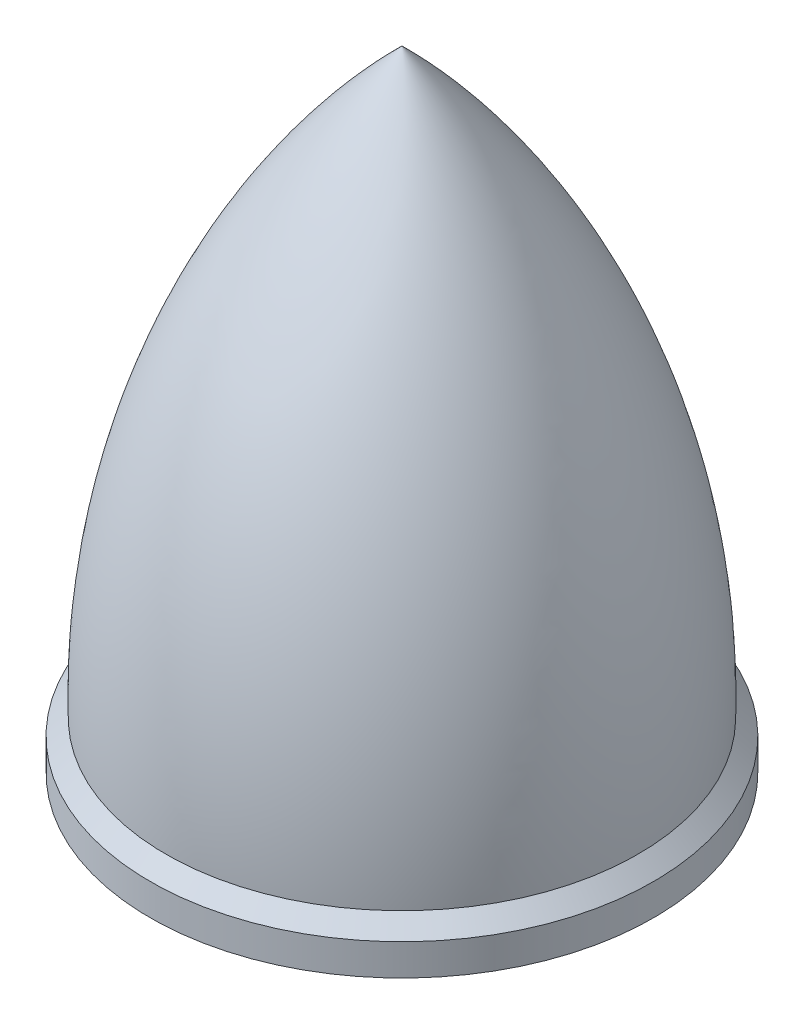
ISO-10303-21;
HEADER;
FILE_DESCRIPTION(('STEP AP214'),'2;1');
FILE_NAME('part.step','',(''),(''),'','','');
FILE_SCHEMA(('AUTOMOTIVE_DESIGN { 1 0 10303 214 1 1 1 1 }'));
ENDSEC;
DATA;
#1=APPLICATION_CONTEXT('core data for automotive mechanical design processes');
#2=APPLICATION_PROTOCOL_DEFINITION('international standard','automotive_design',2000,#1);
#3=PRODUCT_CONTEXT('',#1,'mechanical');
#4=PRODUCT('Part','Part','',(#3));
#5=PRODUCT_RELATED_PRODUCT_CATEGORY('part','',(#4));
#6=PRODUCT_DEFINITION_FORMATION('','',#4);
#7=PRODUCT_DEFINITION_CONTEXT('part definition',#1,'design');
#8=PRODUCT_DEFINITION('design','',#6,#7);
#9=PRODUCT_DEFINITION_SHAPE('','',#8);
#10=(LENGTH_UNIT() NAMED_UNIT(*) SI_UNIT(.MILLI.,.METRE.));
#11=(NAMED_UNIT(*) PLANE_ANGLE_UNIT() SI_UNIT($,.RADIAN.));
#12=(NAMED_UNIT(*) SI_UNIT($,.STERADIAN.) SOLID_ANGLE_UNIT());
#13=UNCERTAINTY_MEASURE_WITH_UNIT(LENGTH_MEASURE(1.E-05),#10,'distance_accuracy_value','');
#14=(GEOMETRIC_REPRESENTATION_CONTEXT(3) GLOBAL_UNCERTAINTY_ASSIGNED_CONTEXT((#13)) GLOBAL_UNIT_ASSIGNED_CONTEXT((#10,
#11,#12)) REPRESENTATION_CONTEXT('',''));
#15=CARTESIAN_POINT('',(0.,0.,0.));
#16=DIRECTION('',(0.,0.,1.));
#17=DIRECTION('',(1.,0.,0.));
#18=AXIS2_PLACEMENT_3D('',#15,#16,#17);
#19=CARTESIAN_POINT('',(0.,0.,0.));
#20=DIRECTION('',(0.,-1.,0.));
#21=DIRECTION('',(0.,0.,-1.));
#22=AXIS2_PLACEMENT_3D('',#19,#20,#21);
#23=PLANE('',#22);
#24=CARTESIAN_POINT('',(0.,0.,0.));
#25=DIRECTION('',(0.,-1.,0.));
#26=DIRECTION('',(0.,0.,-1.));
#27=AXIS2_PLACEMENT_3D('',#24,#25,#26);
#28=CIRCLE('',#27,2.5);
#29=CARTESIAN_POINT('',(0.,0.,-2.5));
#30=VERTEX_POINT('',#29);
#31=EDGE_CURVE('E58',#30,#30,#28,.T.);
#32=ORIENTED_EDGE('',*,*,#31,.F.);
#33=EDGE_LOOP('',(#32));
#34=FACE_BOUND('',#33,.T.);
#35=CARTESIAN_POINT('',(0.,0.,0.));
#36=DIRECTION('',(0.,-1.,0.));
#37=DIRECTION('',(0.,0.,-1.));
#38=AXIS2_PLACEMENT_3D('',#35,#36,#37);
#39=CIRCLE('',#38,8.);
#40=CARTESIAN_POINT('',(0.,0.,-8.));
#41=VERTEX_POINT('',#40);
#42=EDGE_CURVE('E11',#41,#41,#39,.T.);
#43=ORIENTED_EDGE('',*,*,#42,.T.);
#44=EDGE_LOOP('',(#43));
#45=FACE_BOUND('',#44,.T.);
#46=ADVANCED_FACE('F34',(#34,#45),#23,.T.);
#47=CARTESIAN_POINT('',(0.,0.,0.));
#48=DIRECTION('',(0.,-1.,0.));
#49=DIRECTION('',(0.,0.,-1.));
#50=AXIS2_PLACEMENT_3D('',#47,#48,#49);
#51=CYLINDRICAL_SURFACE('',#50,8.);
#52=CARTESIAN_POINT('',(0.,1.,0.));
#53=DIRECTION('',(0.,-1.,0.));
#54=DIRECTION('',(0.,0.,-1.));
#55=AXIS2_PLACEMENT_3D('',#52,#53,#54);
#56=CIRCLE('',#55,8.);
#57=CARTESIAN_POINT('',(0.,1.,-8.));
#58=VERTEX_POINT('',#57);
#59=EDGE_CURVE('E41',#58,#58,#56,.T.);
#60=ORIENTED_EDGE('',*,*,#59,.T.);
#61=EDGE_LOOP('',(#60));
#62=FACE_BOUND('',#61,.T.);
#63=ORIENTED_EDGE('',*,*,#42,.F.);
#64=EDGE_LOOP('',(#63));
#65=FACE_BOUND('',#64,.T.);
#66=ADVANCED_FACE('F67',(#62,#65),#51,.T.);
#67=CARTESIAN_POINT('',(0.,1.,0.));
#68=DIRECTION('',(0.,-1.,0.));
#69=DIRECTION('',(0.,0.,-1.));
#70=AXIS2_PLACEMENT_3D('',#67,#68,#69);
#71=CONICAL_SURFACE('',#70,8.,0.785398163397449);
#72=CARTESIAN_POINT('',(0.,1.5,0.));
#73=DIRECTION('',(0.,-1.,0.));
#74=DIRECTION('',(0.,0.,-1.));
#75=AXIS2_PLACEMENT_3D('',#72,#73,#74);
#76=CIRCLE('',#75,7.5);
#77=CARTESIAN_POINT('',(0.,1.5,-7.5));
#78=VERTEX_POINT('',#77);
#79=EDGE_CURVE('E57',#78,#78,#76,.T.);
#80=ORIENTED_EDGE('',*,*,#79,.T.);
#81=EDGE_LOOP('',(#80));
#82=FACE_BOUND('',#81,.T.);
#83=ORIENTED_EDGE('',*,*,#59,.F.);
#84=EDGE_LOOP('',(#83));
#85=FACE_BOUND('',#84,.T.);
#86=ADVANCED_FACE('F70',(#82,#85),#71,.T.);
#87=CARTESIAN_POINT('',(0.,2.1384405908124,17.4918465426627));
#88=DIRECTION('',(-1.,0.,0.));
#89=DIRECTION('',(0.,0.,-1.));
#90=AXIS2_PLACEMENT_3D('',#87,#88,#89);
#91=CIRCLE('',#90,25.);
#92=TRIMMED_CURVE('',#91,(PARAMETER_VALUE(-0.795855412987337)),
(PARAMETER_VALUE(0.795855412987337)),.T.,.PARAMETER.);
#93=CARTESIAN_POINT('',(0.,2.1384405908124,0.));
#94=DIRECTION('',(0.,-1.,0.));
#95=AXIS1_PLACEMENT('',#93,#94);
#96=SURFACE_OF_REVOLUTION('',#92,#95);
#97=CARTESIAN_POINT('',(0.,20.,0.));
#98=VERTEX_POINT('',#97);
#99=VERTEX_LOOP('',#98);
#100=FACE_BOUND('',#99,.T.);
#101=ORIENTED_EDGE('',*,*,#79,.F.);
#102=EDGE_LOOP('',(#101));
#103=FACE_BOUND('',#102,.T.);
#104=ADVANCED_FACE('F51',(#100,#103),#96,.T.);
#105=CARTESIAN_POINT('',(0.,10.,0.));
#106=DIRECTION('',(0.,-1.,0.));
#107=DIRECTION('',(0.,0.,-1.));
#108=AXIS2_PLACEMENT_3D('',#105,#106,#107);
#109=CONICAL_SURFACE('',#108,2.5,1.02974425867665);
#110=CARTESIAN_POINT('',(0.,11.5021515475689,0.));
#111=VERTEX_POINT('',#110);
#112=VERTEX_LOOP('',#111);
#113=FACE_BOUND('',#112,.T.);
#114=CARTESIAN_POINT('',(0.,10.,0.));
#115=DIRECTION('',(0.,-1.,0.));
#116=DIRECTION('',(0.,0.,-1.));
#117=AXIS2_PLACEMENT_3D('',#114,#115,#116);
#118=CIRCLE('',#117,2.5);
#119=CARTESIAN_POINT('',(0.,10.,-2.5));
#120=VERTEX_POINT('',#119);
#121=EDGE_CURVE('E55',#120,#120,#118,.T.);
#122=ORIENTED_EDGE('',*,*,#121,.T.);
#123=EDGE_LOOP('',(#122));
#124=FACE_BOUND('',#123,.T.);
#125=ADVANCED_FACE('F47',(#113,#124),#109,.F.);
#126=CARTESIAN_POINT('',(0.,0.,0.));
#127=DIRECTION('',(0.,-1.,0.));
#128=DIRECTION('',(0.,0.,-1.));
#129=AXIS2_PLACEMENT_3D('',#126,#127,#128);
#130=CYLINDRICAL_SURFACE('',#129,2.5);
#131=ORIENTED_EDGE('',*,*,#121,.F.);
#132=EDGE_LOOP('',(#131));
#133=FACE_BOUND('',#132,.T.);
#134=ORIENTED_EDGE('',*,*,#31,.T.);
#135=EDGE_LOOP('',(#134));
#136=FACE_BOUND('',#135,.T.);
#137=ADVANCED_FACE('F50',(#133,#136),#130,.F.);
#138=CLOSED_SHELL('',(#46,#66,#86,#104,#125,#137));
#139=MANIFOLD_SOLID_BREP('B2',#138);
#140=ADVANCED_BREP_SHAPE_REPRESENTATION('',(#18,#139),#14);
#141=SHAPE_DEFINITION_REPRESENTATION(#9,#140);
ENDSEC;
END-ISO-10303-21;
